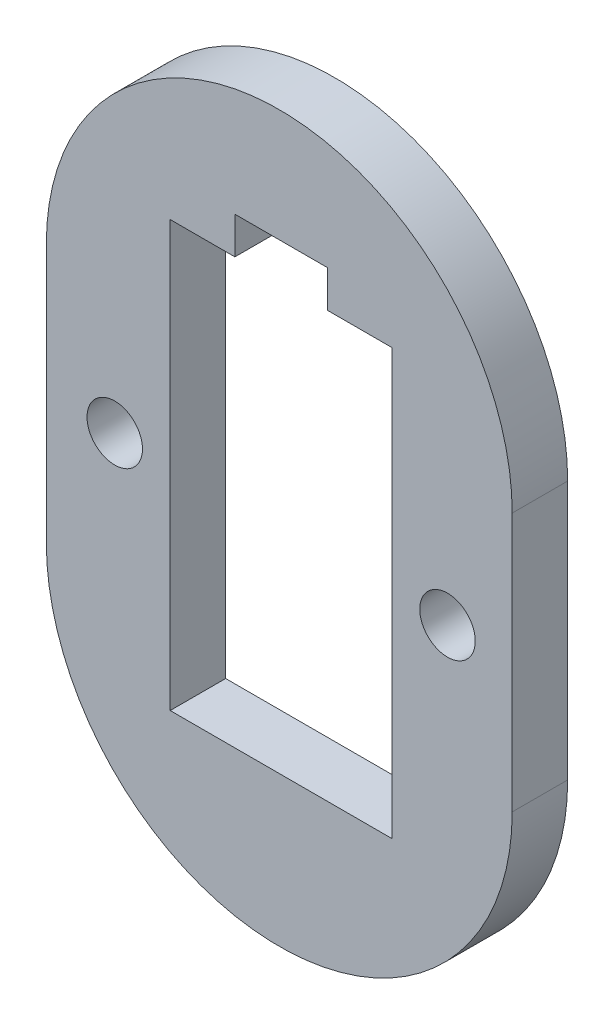
ISO-10303-21;
HEADER;
FILE_DESCRIPTION(('STEP AP214'),'2;1');
FILE_NAME('part.step','',(''),(''),'','','');
FILE_SCHEMA(('AUTOMOTIVE_DESIGN { 1 0 10303 214 1 1 1 1 }'));
ENDSEC;
DATA;
#1=APPLICATION_CONTEXT('core data for automotive mechanical design processes');
#2=APPLICATION_PROTOCOL_DEFINITION('international standard','automotive_design',2000,#1);
#3=PRODUCT_CONTEXT('',#1,'mechanical');
#4=PRODUCT('Part','Part','',(#3));
#5=PRODUCT_RELATED_PRODUCT_CATEGORY('part','',(#4));
#6=PRODUCT_DEFINITION_FORMATION('','',#4);
#7=PRODUCT_DEFINITION_CONTEXT('part definition',#1,'design');
#8=PRODUCT_DEFINITION('design','',#6,#7);
#9=PRODUCT_DEFINITION_SHAPE('','',#8);
#10=(LENGTH_UNIT() NAMED_UNIT(*) SI_UNIT(.MILLI.,.METRE.));
#11=(NAMED_UNIT(*) PLANE_ANGLE_UNIT() SI_UNIT($,.RADIAN.));
#12=(NAMED_UNIT(*) SI_UNIT($,.STERADIAN.) SOLID_ANGLE_UNIT());
#13=UNCERTAINTY_MEASURE_WITH_UNIT(LENGTH_MEASURE(1.E-05),#10,'distance_accuracy_value','');
#14=(GEOMETRIC_REPRESENTATION_CONTEXT(3) GLOBAL_UNCERTAINTY_ASSIGNED_CONTEXT((#13)) GLOBAL_UNIT_ASSIGNED_CONTEXT((#10,
#11,#12)) REPRESENTATION_CONTEXT('',''));
#15=CARTESIAN_POINT('',(0.,0.,0.));
#16=DIRECTION('',(0.,0.,1.));
#17=DIRECTION('',(1.,0.,0.));
#18=AXIS2_PLACEMENT_3D('',#15,#16,#17);
#19=CARTESIAN_POINT('',(13.4862399999939,25.2090395610512,3.));
#20=DIRECTION('',(0.,0.,1.));
#21=DIRECTION('',(1.,0.,0.));
#22=AXIS2_PLACEMENT_3D('',#19,#20,#21);
#23=PLANE('',#22);
#24=CARTESIAN_POINT('',(4.58628999666049,18.2090395573245,3.));
#25=DIRECTION('',(0.,0.,1.));
#26=DIRECTION('',(1.,0.,0.));
#27=AXIS2_PLACEMENT_3D('',#24,#25,#26);
#28=CIRCLE('',#27,1.5);
#29=CARTESIAN_POINT('',(6.08628999666049,18.2090395573245,3.));
#30=VERTEX_POINT('',#29);
#31=EDGE_CURVE('E194',#30,#30,#28,.T.);
#32=ORIENTED_EDGE('',*,*,#31,.F.);
#33=EDGE_LOOP('',(#32));
#34=FACE_BOUND('',#33,.T.);
#35=CARTESIAN_POINT('',(13.4862399999939,25.2090395610512,3.));
#36=DIRECTION('',(0.,0.,1.));
#37=DIRECTION('',(1.,0.,0.));
#38=AXIS2_PLACEMENT_3D('',#35,#36,#37);
#39=CIRCLE('',#38,12.6000000000992);
#40=CARTESIAN_POINT('',(26.0862399999939,25.2089895613504,3.));
#41=VERTEX_POINT('',#40);
#42=CARTESIAN_POINT('',(0.886239999993869,25.2090895607519,3.));
#43=VERTEX_POINT('',#42);
#44=EDGE_CURVE('E200',#41,#43,#39,.T.);
#45=ORIENTED_EDGE('',*,*,#44,.T.);
#46=DIRECTION('',(0.,-1.,0.));
#47=VECTOR('',#46,1.);
#48=CARTESIAN_POINT('',(0.886239999993869,25.2090895607519,3.));
#49=LINE('',#48,#47);
#50=CARTESIAN_POINT('',(0.886239999993911,11.208991882425,3.));
#51=VERTEX_POINT('',#50);
#52=EDGE_CURVE('E203',#43,#51,#49,.T.);
#53=ORIENTED_EDGE('',*,*,#52,.T.);
#54=CARTESIAN_POINT('',(13.4862399999939,11.208990720976,3.));
#55=DIRECTION('',(0.,0.,1.));
#56=DIRECTION('',(1.,0.,0.));
#57=AXIS2_PLACEMENT_3D('',#54,#55,#56);
#58=CIRCLE('',#57,12.6);
#59=CARTESIAN_POINT('',(26.0862399999939,11.2089895595271,3.));
#60=VERTEX_POINT('',#59);
#61=EDGE_CURVE('E206',#51,#60,#58,.T.);
#62=ORIENTED_EDGE('',*,*,#61,.T.);
#63=DIRECTION('',(0.,1.,0.));
#64=VECTOR('',#63,1.);
#65=CARTESIAN_POINT('',(26.0862399999939,16.2089895606585,3.));
#66=LINE('',#65,#64);
#67=EDGE_CURVE('E208',#60,#41,#66,.T.);
#68=ORIENTED_EDGE('',*,*,#67,.T.);
#69=EDGE_LOOP('',(#45,#53,#62,#68));
#70=FACE_BOUND('',#69,.T.);
#71=CARTESIAN_POINT('',(22.5862899966605,18.2090395573245,3.));
#72=DIRECTION('',(0.,0.,1.));
#73=DIRECTION('',(1.,0.,0.));
#74=AXIS2_PLACEMENT_3D('',#71,#72,#73);
#75=CIRCLE('',#74,1.5);
#76=CARTESIAN_POINT('',(24.0862899966605,18.2090395573245,3.));
#77=VERTEX_POINT('',#76);
#78=EDGE_CURVE('E188',#77,#77,#75,.T.);
#79=ORIENTED_EDGE('',*,*,#78,.F.);
#80=EDGE_LOOP('',(#79));
#81=FACE_BOUND('',#80,.T.);
#82=DIRECTION('',(0.,1.,0.));
#83=VECTOR('',#82,1.);
#84=CARTESIAN_POINT('',(19.5862399999939,6.70898956065786,3.));
#85=LINE('',#84,#83);
#86=CARTESIAN_POINT('',(19.5862399999939,6.70898956065786,3.));
#87=VERTEX_POINT('',#86);
#88=CARTESIAN_POINT('',(19.5862399999939,29.7089895606578,3.));
#89=VERTEX_POINT('',#88);
#90=EDGE_CURVE('E131',#87,#89,#85,.T.);
#91=ORIENTED_EDGE('',*,*,#90,.F.);
#92=DIRECTION('',(1.,0.,0.));
#93=VECTOR('',#92,1.);
#94=CARTESIAN_POINT('',(7.58623999999389,6.70898956065782,3.));
#95=LINE('',#94,#93);
#96=CARTESIAN_POINT('',(7.58623999999389,6.70898956065782,3.));
#97=VERTEX_POINT('',#96);
#98=EDGE_CURVE('E123',#97,#87,#95,.T.);
#99=ORIENTED_EDGE('',*,*,#98,.F.);
#100=DIRECTION('',(0.,-1.,0.));
#101=VECTOR('',#100,1.);
#102=CARTESIAN_POINT('',(7.58623999999389,29.7089895606578,3.));
#103=LINE('',#102,#101);
#104=CARTESIAN_POINT('',(7.58623999999389,29.7089895606578,3.));
#105=VERTEX_POINT('',#104);
#106=EDGE_CURVE('E156',#105,#97,#103,.T.);
#107=ORIENTED_EDGE('',*,*,#106,.F.);
#108=DIRECTION('',(-1.,0.,0.));
#109=VECTOR('',#108,1.);
#110=CARTESIAN_POINT('',(11.0862399999939,29.7089895606578,3.));
#111=LINE('',#110,#109);
#112=CARTESIAN_POINT('',(11.0862399999939,29.7089895606578,3.));
#113=VERTEX_POINT('',#112);
#114=EDGE_CURVE('E154',#113,#105,#111,.T.);
#115=ORIENTED_EDGE('',*,*,#114,.F.);
#116=DIRECTION('',(0.,-1.,0.));
#117=VECTOR('',#116,1.);
#118=CARTESIAN_POINT('',(11.0862399999939,31.7089895606578,3.));
#119=LINE('',#118,#117);
#120=CARTESIAN_POINT('',(11.0862399999939,31.7089895606578,3.));
#121=VERTEX_POINT('',#120);
#122=EDGE_CURVE('E152',#121,#113,#119,.T.);
#123=ORIENTED_EDGE('',*,*,#122,.F.);
#124=DIRECTION('',(-1.,0.,0.));
#125=VECTOR('',#124,1.);
#126=CARTESIAN_POINT('',(16.0862399999939,31.7089895606579,3.));
#127=LINE('',#126,#125);
#128=CARTESIAN_POINT('',(16.0862399999939,31.7089895606579,3.));
#129=VERTEX_POINT('',#128);
#130=EDGE_CURVE('E150',#129,#121,#127,.T.);
#131=ORIENTED_EDGE('',*,*,#130,.F.);
#132=DIRECTION('',(0.,1.,0.));
#133=VECTOR('',#132,1.);
#134=CARTESIAN_POINT('',(16.0862399999939,29.7089895606578,3.));
#135=LINE('',#134,#133);
#136=CARTESIAN_POINT('',(16.0862399999939,29.7089895606578,3.));
#137=VERTEX_POINT('',#136);
#138=EDGE_CURVE('E146',#137,#129,#135,.T.);
#139=ORIENTED_EDGE('',*,*,#138,.F.);
#140=DIRECTION('',(-1.,0.,0.));
#141=VECTOR('',#140,1.);
#142=CARTESIAN_POINT('',(19.5862399999939,29.7089895606578,3.));
#143=LINE('',#142,#141);
#144=EDGE_CURVE('E144',#89,#137,#143,.T.);
#145=ORIENTED_EDGE('',*,*,#144,.F.);
#146=EDGE_LOOP('',(#91,#99,#107,#115,#123,#131,#139,#145));
#147=FACE_BOUND('',#146,.T.);
#148=ADVANCED_FACE('F34',(#34,#70,#81,#147),#23,.T.);
#149=CARTESIAN_POINT('',(13.4862399999939,25.2090395610512,0.));
#150=DIRECTION('',(0.,0.,1.));
#151=DIRECTION('',(1.,0.,0.));
#152=AXIS2_PLACEMENT_3D('',#149,#150,#151);
#153=PLANE('',#152);
#154=CARTESIAN_POINT('',(22.5862899966605,18.2090395573245,0.));
#155=DIRECTION('',(0.,0.,1.));
#156=DIRECTION('',(1.,0.,0.));
#157=AXIS2_PLACEMENT_3D('',#154,#155,#156);
#158=CIRCLE('',#157,1.5);
#159=CARTESIAN_POINT('',(24.0862899966605,18.2090395573245,0.));
#160=VERTEX_POINT('',#159);
#161=EDGE_CURVE('E139',#160,#160,#158,.T.);
#162=ORIENTED_EDGE('',*,*,#161,.T.);
#163=EDGE_LOOP('',(#162));
#164=FACE_BOUND('',#163,.T.);
#165=CARTESIAN_POINT('',(4.58628999666049,18.2090395573245,0.));
#166=DIRECTION('',(0.,0.,1.));
#167=DIRECTION('',(1.,0.,0.));
#168=AXIS2_PLACEMENT_3D('',#165,#166,#167);
#169=CIRCLE('',#168,1.5);
#170=CARTESIAN_POINT('',(6.08628999666049,18.2090395573245,0.));
#171=VERTEX_POINT('',#170);
#172=EDGE_CURVE('E191',#171,#171,#169,.T.);
#173=ORIENTED_EDGE('',*,*,#172,.T.);
#174=EDGE_LOOP('',(#173));
#175=FACE_BOUND('',#174,.T.);
#176=CARTESIAN_POINT('',(13.4862399999939,25.2090395610512,0.));
#177=DIRECTION('',(0.,0.,1.));
#178=DIRECTION('',(1.,0.,0.));
#179=AXIS2_PLACEMENT_3D('',#176,#177,#178);
#180=CIRCLE('',#179,12.6000000000992);
#181=CARTESIAN_POINT('',(26.0862399999939,25.2089895613504,0.));
#182=VERTEX_POINT('',#181);
#183=CARTESIAN_POINT('',(0.886239999993869,25.2090895607519,0.));
#184=VERTEX_POINT('',#183);
#185=EDGE_CURVE('E197',#182,#184,#180,.T.);
#186=ORIENTED_EDGE('',*,*,#185,.F.);
#187=DIRECTION('',(0.,1.,0.));
#188=VECTOR('',#187,1.);
#189=CARTESIAN_POINT('',(26.0862399999939,16.2089895606585,0.));
#190=LINE('',#189,#188);
#191=CARTESIAN_POINT('',(26.0862399999939,11.2089895595271,0.));
#192=VERTEX_POINT('',#191);
#193=EDGE_CURVE('E204',#192,#182,#190,.T.);
#194=ORIENTED_EDGE('',*,*,#193,.F.);
#195=CARTESIAN_POINT('',(13.4862399999939,11.208990720976,0.));
#196=DIRECTION('',(0.,0.,1.));
#197=DIRECTION('',(1.,0.,0.));
#198=AXIS2_PLACEMENT_3D('',#195,#196,#197);
#199=CIRCLE('',#198,12.6);
#200=CARTESIAN_POINT('',(0.886239999993911,11.208991882425,0.));
#201=VERTEX_POINT('',#200);
#202=EDGE_CURVE('E215',#201,#192,#199,.T.);
#203=ORIENTED_EDGE('',*,*,#202,.F.);
#204=DIRECTION('',(0.,-1.,0.));
#205=VECTOR('',#204,1.);
#206=CARTESIAN_POINT('',(0.886239999993869,25.2090895607519,0.));
#207=LINE('',#206,#205);
#208=EDGE_CURVE('E213',#184,#201,#207,.T.);
#209=ORIENTED_EDGE('',*,*,#208,.F.);
#210=EDGE_LOOP('',(#186,#194,#203,#209));
#211=FACE_BOUND('',#210,.T.);
#212=DIRECTION('',(1.,0.,0.));
#213=VECTOR('',#212,1.);
#214=CARTESIAN_POINT('',(7.58623999999389,6.70898956065782,0.));
#215=LINE('',#214,#213);
#216=CARTESIAN_POINT('',(7.58623999999389,6.70898956065782,0.));
#217=VERTEX_POINT('',#216);
#218=CARTESIAN_POINT('',(19.5862399999939,6.70898956065786,0.));
#219=VERTEX_POINT('',#218);
#220=EDGE_CURVE('E57',#217,#219,#215,.T.);
#221=ORIENTED_EDGE('',*,*,#220,.T.);
#222=DIRECTION('',(0.,1.,0.));
#223=VECTOR('',#222,1.);
#224=CARTESIAN_POINT('',(19.5862399999939,6.70898956065786,0.));
#225=LINE('',#224,#223);
#226=CARTESIAN_POINT('',(19.5862399999939,29.7089895606578,0.));
#227=VERTEX_POINT('',#226);
#228=EDGE_CURVE('E138',#219,#227,#225,.T.);
#229=ORIENTED_EDGE('',*,*,#228,.T.);
#230=DIRECTION('',(-1.,0.,0.));
#231=VECTOR('',#230,1.);
#232=CARTESIAN_POINT('',(19.5862399999939,29.7089895606578,0.));
#233=LINE('',#232,#231);
#234=CARTESIAN_POINT('',(16.0862399999939,29.7089895606578,0.));
#235=VERTEX_POINT('',#234);
#236=EDGE_CURVE('E160',#227,#235,#233,.T.);
#237=ORIENTED_EDGE('',*,*,#236,.T.);
#238=DIRECTION('',(0.,1.,0.));
#239=VECTOR('',#238,1.);
#240=CARTESIAN_POINT('',(16.0862399999939,29.7089895606578,0.));
#241=LINE('',#240,#239);
#242=CARTESIAN_POINT('',(16.0862399999939,31.7089895606579,0.));
#243=VERTEX_POINT('',#242);
#244=EDGE_CURVE('E163',#235,#243,#241,.T.);
#245=ORIENTED_EDGE('',*,*,#244,.T.);
#246=DIRECTION('',(-1.,0.,0.));
#247=VECTOR('',#246,1.);
#248=CARTESIAN_POINT('',(16.0862399999939,31.7089895606579,0.));
#249=LINE('',#248,#247);
#250=CARTESIAN_POINT('',(11.0862399999939,31.7089895606578,0.));
#251=VERTEX_POINT('',#250);
#252=EDGE_CURVE('E166',#243,#251,#249,.T.);
#253=ORIENTED_EDGE('',*,*,#252,.T.);
#254=DIRECTION('',(0.,-1.,0.));
#255=VECTOR('',#254,1.);
#256=CARTESIAN_POINT('',(11.0862399999939,31.7089895606578,0.));
#257=LINE('',#256,#255);
#258=CARTESIAN_POINT('',(11.0862399999939,29.7089895606578,0.));
#259=VERTEX_POINT('',#258);
#260=EDGE_CURVE('E169',#251,#259,#257,.T.);
#261=ORIENTED_EDGE('',*,*,#260,.T.);
#262=DIRECTION('',(-1.,0.,0.));
#263=VECTOR('',#262,1.);
#264=CARTESIAN_POINT('',(11.0862399999939,29.7089895606578,0.));
#265=LINE('',#264,#263);
#266=CARTESIAN_POINT('',(7.58623999999389,29.7089895606578,0.));
#267=VERTEX_POINT('',#266);
#268=EDGE_CURVE('E172',#259,#267,#265,.T.);
#269=ORIENTED_EDGE('',*,*,#268,.T.);
#270=DIRECTION('',(0.,-1.,0.));
#271=VECTOR('',#270,1.);
#272=CARTESIAN_POINT('',(7.58623999999389,29.7089895606578,0.));
#273=LINE('',#272,#271);
#274=EDGE_CURVE('E132',#267,#217,#273,.T.);
#275=ORIENTED_EDGE('',*,*,#274,.T.);
#276=EDGE_LOOP('',(#221,#229,#237,#245,#253,#261,#269,#275));
#277=FACE_BOUND('',#276,.T.);
#278=ADVANCED_FACE('F233',(#164,#175,#211,#277),#153,.F.);
#279=CARTESIAN_POINT('',(13.4862399999939,25.2090395610512,3.));
#280=DIRECTION('',(0.,0.,-1.));
#281=DIRECTION('',(-1.,0.,0.));
#282=AXIS2_PLACEMENT_3D('',#279,#280,#281);
#283=CYLINDRICAL_SURFACE('',#282,12.6000000000992);
#284=ORIENTED_EDGE('',*,*,#185,.T.);
#285=DIRECTION('',(0.,0.,-1.));
#286=VECTOR('',#285,1.);
#287=CARTESIAN_POINT('',(0.886239999993869,25.2090895607519,3.));
#288=LINE('',#287,#286);
#289=EDGE_CURVE('E11',#43,#184,#288,.T.);
#290=ORIENTED_EDGE('',*,*,#289,.F.);
#291=ORIENTED_EDGE('',*,*,#44,.F.);
#292=DIRECTION('',(0.,0.,-1.));
#293=VECTOR('',#292,1.);
#294=CARTESIAN_POINT('',(26.0862399999939,25.2089895613504,3.));
#295=LINE('',#294,#293);
#296=EDGE_CURVE('E210',#41,#182,#295,.T.);
#297=ORIENTED_EDGE('',*,*,#296,.T.);
#298=EDGE_LOOP('',(#284,#290,#291,#297));
#299=FACE_BOUND('',#298,.T.);
#300=ADVANCED_FACE('F36',(#299),#283,.T.);
#301=CARTESIAN_POINT('',(0.886239999993869,25.2090895607519,3.));
#302=DIRECTION('',(1.,0.,0.));
#303=DIRECTION('',(0.,1.,0.));
#304=AXIS2_PLACEMENT_3D('',#301,#302,#303);
#305=PLANE('',#304);
#306=ORIENTED_EDGE('',*,*,#208,.T.);
#307=DIRECTION('',(0.,0.,-1.));
#308=VECTOR('',#307,1.);
#309=CARTESIAN_POINT('',(0.886239999993911,11.208991882425,3.));
#310=LINE('',#309,#308);
#311=EDGE_CURVE('E42',#51,#201,#310,.T.);
#312=ORIENTED_EDGE('',*,*,#311,.F.);
#313=ORIENTED_EDGE('',*,*,#52,.F.);
#314=ORIENTED_EDGE('',*,*,#289,.T.);
#315=EDGE_LOOP('',(#306,#312,#313,#314));
#316=FACE_BOUND('',#315,.T.);
#317=ADVANCED_FACE('F244',(#316),#305,.F.);
#318=CARTESIAN_POINT('',(13.4862399999939,11.208990720976,3.));
#319=DIRECTION('',(0.,0.,-1.));
#320=DIRECTION('',(-1.,0.,0.));
#321=AXIS2_PLACEMENT_3D('',#318,#319,#320);
#322=CYLINDRICAL_SURFACE('',#321,12.6);
#323=ORIENTED_EDGE('',*,*,#202,.T.);
#324=DIRECTION('',(0.,0.,-1.));
#325=VECTOR('',#324,1.);
#326=CARTESIAN_POINT('',(26.0862399999939,11.2089895595271,3.));
#327=LINE('',#326,#325);
#328=EDGE_CURVE('E221',#60,#192,#327,.T.);
#329=ORIENTED_EDGE('',*,*,#328,.F.);
#330=ORIENTED_EDGE('',*,*,#61,.F.);
#331=ORIENTED_EDGE('',*,*,#311,.T.);
#332=EDGE_LOOP('',(#323,#329,#330,#331));
#333=FACE_BOUND('',#332,.T.);
#334=ADVANCED_FACE('F228',(#333),#322,.T.);
#335=CARTESIAN_POINT('',(26.0862399999939,16.2089895606585,3.));
#336=DIRECTION('',(-1.,0.,0.));
#337=DIRECTION('',(0.,0.,1.));
#338=AXIS2_PLACEMENT_3D('',#335,#336,#337);
#339=PLANE('',#338);
#340=ORIENTED_EDGE('',*,*,#193,.T.);
#341=ORIENTED_EDGE('',*,*,#296,.F.);
#342=ORIENTED_EDGE('',*,*,#67,.F.);
#343=ORIENTED_EDGE('',*,*,#328,.T.);
#344=EDGE_LOOP('',(#340,#341,#342,#343));
#345=FACE_BOUND('',#344,.T.);
#346=ADVANCED_FACE('F237',(#345),#339,.F.);
#347=CARTESIAN_POINT('',(4.58628999666049,18.2090395573245,3.));
#348=DIRECTION('',(0.,0.,-1.));
#349=DIRECTION('',(-1.,0.,0.));
#350=AXIS2_PLACEMENT_3D('',#347,#348,#349);
#351=CYLINDRICAL_SURFACE('',#350,1.5);
#352=ORIENTED_EDGE('',*,*,#31,.T.);
#353=EDGE_LOOP('',(#352));
#354=FACE_BOUND('',#353,.T.);
#355=ORIENTED_EDGE('',*,*,#172,.F.);
#356=EDGE_LOOP('',(#355));
#357=FACE_BOUND('',#356,.T.);
#358=ADVANCED_FACE('F261',(#354,#357),#351,.F.);
#359=CARTESIAN_POINT('',(22.5862899966605,18.2090395573245,3.));
#360=DIRECTION('',(0.,0.,-1.));
#361=DIRECTION('',(-1.,0.,0.));
#362=AXIS2_PLACEMENT_3D('',#359,#360,#361);
#363=CYLINDRICAL_SURFACE('',#362,1.5);
#364=ORIENTED_EDGE('',*,*,#78,.T.);
#365=EDGE_LOOP('',(#364));
#366=FACE_BOUND('',#365,.T.);
#367=ORIENTED_EDGE('',*,*,#161,.F.);
#368=EDGE_LOOP('',(#367));
#369=FACE_BOUND('',#368,.T.);
#370=ADVANCED_FACE('F268',(#366,#369),#363,.F.);
#371=CARTESIAN_POINT('',(7.58623999999389,6.70898956065782,3.));
#372=DIRECTION('',(0.,1.,0.));
#373=DIRECTION('',(-1.,0.,0.));
#374=AXIS2_PLACEMENT_3D('',#371,#372,#373);
#375=PLANE('',#374);
#376=ORIENTED_EDGE('',*,*,#220,.F.);
#377=DIRECTION('',(0.,0.,-1.));
#378=VECTOR('',#377,1.);
#379=CARTESIAN_POINT('',(7.58623999999389,6.70898956065782,3.));
#380=LINE('',#379,#378);
#381=EDGE_CURVE('E127',#97,#217,#380,.T.);
#382=ORIENTED_EDGE('',*,*,#381,.F.);
#383=ORIENTED_EDGE('',*,*,#98,.T.);
#384=DIRECTION('',(0.,0.,-1.));
#385=VECTOR('',#384,1.);
#386=CARTESIAN_POINT('',(19.5862399999939,6.70898956065786,3.));
#387=LINE('',#386,#385);
#388=EDGE_CURVE('E126',#87,#219,#387,.T.);
#389=ORIENTED_EDGE('',*,*,#388,.T.);
#390=EDGE_LOOP('',(#376,#382,#383,#389));
#391=FACE_BOUND('',#390,.T.);
#392=ADVANCED_FACE('F125',(#391),#375,.T.);
#393=CARTESIAN_POINT('',(19.5862399999939,6.70898956065786,3.));
#394=DIRECTION('',(-1.,0.,0.));
#395=DIRECTION('',(0.,0.,1.));
#396=AXIS2_PLACEMENT_3D('',#393,#394,#395);
#397=PLANE('',#396);
#398=ORIENTED_EDGE('',*,*,#228,.F.);
#399=ORIENTED_EDGE('',*,*,#388,.F.);
#400=ORIENTED_EDGE('',*,*,#90,.T.);
#401=DIRECTION('',(0.,0.,-1.));
#402=VECTOR('',#401,1.);
#403=CARTESIAN_POINT('',(19.5862399999939,29.7089895606578,3.));
#404=LINE('',#403,#402);
#405=EDGE_CURVE('E140',#89,#227,#404,.T.);
#406=ORIENTED_EDGE('',*,*,#405,.T.);
#407=EDGE_LOOP('',(#398,#399,#400,#406));
#408=FACE_BOUND('',#407,.T.);
#409=ADVANCED_FACE('F135',(#408),#397,.T.);
#410=CARTESIAN_POINT('',(19.5862399999939,29.7089895606578,3.));
#411=DIRECTION('',(0.,-1.,0.));
#412=DIRECTION('',(1.,0.,0.));
#413=AXIS2_PLACEMENT_3D('',#410,#411,#412);
#414=PLANE('',#413);
#415=ORIENTED_EDGE('',*,*,#236,.F.);
#416=ORIENTED_EDGE('',*,*,#405,.F.);
#417=ORIENTED_EDGE('',*,*,#144,.T.);
#418=DIRECTION('',(0.,0.,-1.));
#419=VECTOR('',#418,1.);
#420=CARTESIAN_POINT('',(16.0862399999939,29.7089895606578,3.));
#421=LINE('',#420,#419);
#422=EDGE_CURVE('E185',#137,#235,#421,.T.);
#423=ORIENTED_EDGE('',*,*,#422,.T.);
#424=EDGE_LOOP('',(#415,#416,#417,#423));
#425=FACE_BOUND('',#424,.T.);
#426=ADVANCED_FACE('F285',(#425),#414,.T.);
#427=CARTESIAN_POINT('',(16.0862399999939,29.7089895606578,3.));
#428=DIRECTION('',(-1.,0.,0.));
#429=DIRECTION('',(0.,0.,1.));
#430=AXIS2_PLACEMENT_3D('',#427,#428,#429);
#431=PLANE('',#430);
#432=ORIENTED_EDGE('',*,*,#244,.F.);
#433=ORIENTED_EDGE('',*,*,#422,.F.);
#434=ORIENTED_EDGE('',*,*,#138,.T.);
#435=DIRECTION('',(0.,0.,-1.));
#436=VECTOR('',#435,1.);
#437=CARTESIAN_POINT('',(16.0862399999939,31.7089895606579,3.));
#438=LINE('',#437,#436);
#439=EDGE_CURVE('E183',#129,#243,#438,.T.);
#440=ORIENTED_EDGE('',*,*,#439,.T.);
#441=EDGE_LOOP('',(#432,#433,#434,#440));
#442=FACE_BOUND('',#441,.T.);
#443=ADVANCED_FACE('F288',(#442),#431,.T.);
#444=CARTESIAN_POINT('',(16.0862399999939,31.7089895606579,3.));
#445=DIRECTION('',(0.,-1.,0.));
#446=DIRECTION('',(1.,0.,0.));
#447=AXIS2_PLACEMENT_3D('',#444,#445,#446);
#448=PLANE('',#447);
#449=ORIENTED_EDGE('',*,*,#252,.F.);
#450=ORIENTED_EDGE('',*,*,#439,.F.);
#451=ORIENTED_EDGE('',*,*,#130,.T.);
#452=DIRECTION('',(0.,0.,-1.));
#453=VECTOR('',#452,1.);
#454=CARTESIAN_POINT('',(11.0862399999939,31.7089895606578,3.));
#455=LINE('',#454,#453);
#456=EDGE_CURVE('E181',#121,#251,#455,.T.);
#457=ORIENTED_EDGE('',*,*,#456,.T.);
#458=EDGE_LOOP('',(#449,#450,#451,#457));
#459=FACE_BOUND('',#458,.T.);
#460=ADVANCED_FACE('F292',(#459),#448,.T.);
#461=CARTESIAN_POINT('',(11.0862399999939,31.7089895606578,3.));
#462=DIRECTION('',(1.,0.,0.));
#463=DIRECTION('',(0.,0.,-1.));
#464=AXIS2_PLACEMENT_3D('',#461,#462,#463);
#465=PLANE('',#464);
#466=ORIENTED_EDGE('',*,*,#260,.F.);
#467=ORIENTED_EDGE('',*,*,#456,.F.);
#468=ORIENTED_EDGE('',*,*,#122,.T.);
#469=DIRECTION('',(0.,0.,-1.));
#470=VECTOR('',#469,1.);
#471=CARTESIAN_POINT('',(11.0862399999939,29.7089895606578,3.));
#472=LINE('',#471,#470);
#473=EDGE_CURVE('E179',#113,#259,#472,.T.);
#474=ORIENTED_EDGE('',*,*,#473,.T.);
#475=EDGE_LOOP('',(#466,#467,#468,#474));
#476=FACE_BOUND('',#475,.T.);
#477=ADVANCED_FACE('F296',(#476),#465,.T.);
#478=CARTESIAN_POINT('',(11.0862399999939,29.7089895606578,3.));
#479=DIRECTION('',(0.,-1.,0.));
#480=DIRECTION('',(1.,0.,0.));
#481=AXIS2_PLACEMENT_3D('',#478,#479,#480);
#482=PLANE('',#481);
#483=ORIENTED_EDGE('',*,*,#268,.F.);
#484=ORIENTED_EDGE('',*,*,#473,.F.);
#485=ORIENTED_EDGE('',*,*,#114,.T.);
#486=DIRECTION('',(0.,0.,-1.));
#487=VECTOR('',#486,1.);
#488=CARTESIAN_POINT('',(7.58623999999389,29.7089895606578,3.));
#489=LINE('',#488,#487);
#490=EDGE_CURVE('E49',#105,#267,#489,.T.);
#491=ORIENTED_EDGE('',*,*,#490,.T.);
#492=EDGE_LOOP('',(#483,#484,#485,#491));
#493=FACE_BOUND('',#492,.T.);
#494=ADVANCED_FACE('F300',(#493),#482,.T.);
#495=CARTESIAN_POINT('',(7.58623999999389,29.7089895606578,3.));
#496=DIRECTION('',(1.,0.,0.));
#497=DIRECTION('',(0.,0.,-1.));
#498=AXIS2_PLACEMENT_3D('',#495,#496,#497);
#499=PLANE('',#498);
#500=ORIENTED_EDGE('',*,*,#274,.F.);
#501=ORIENTED_EDGE('',*,*,#490,.F.);
#502=ORIENTED_EDGE('',*,*,#106,.T.);
#503=ORIENTED_EDGE('',*,*,#381,.T.);
#504=EDGE_LOOP('',(#500,#501,#502,#503));
#505=FACE_BOUND('',#504,.T.);
#506=ADVANCED_FACE('F304',(#505),#499,.T.);
#507=CLOSED_SHELL('',(#148,#278,#300,#317,#334,#346,#358,#370,#392,#409,#426,#443,#460,#477,
#494,#506));
#508=MANIFOLD_SOLID_BREP('B2',#507);
#509=ADVANCED_BREP_SHAPE_REPRESENTATION('',(#18,#508),#14);
#510=SHAPE_DEFINITION_REPRESENTATION(#9,#509);
ENDSEC;
END-ISO-10303-21;
